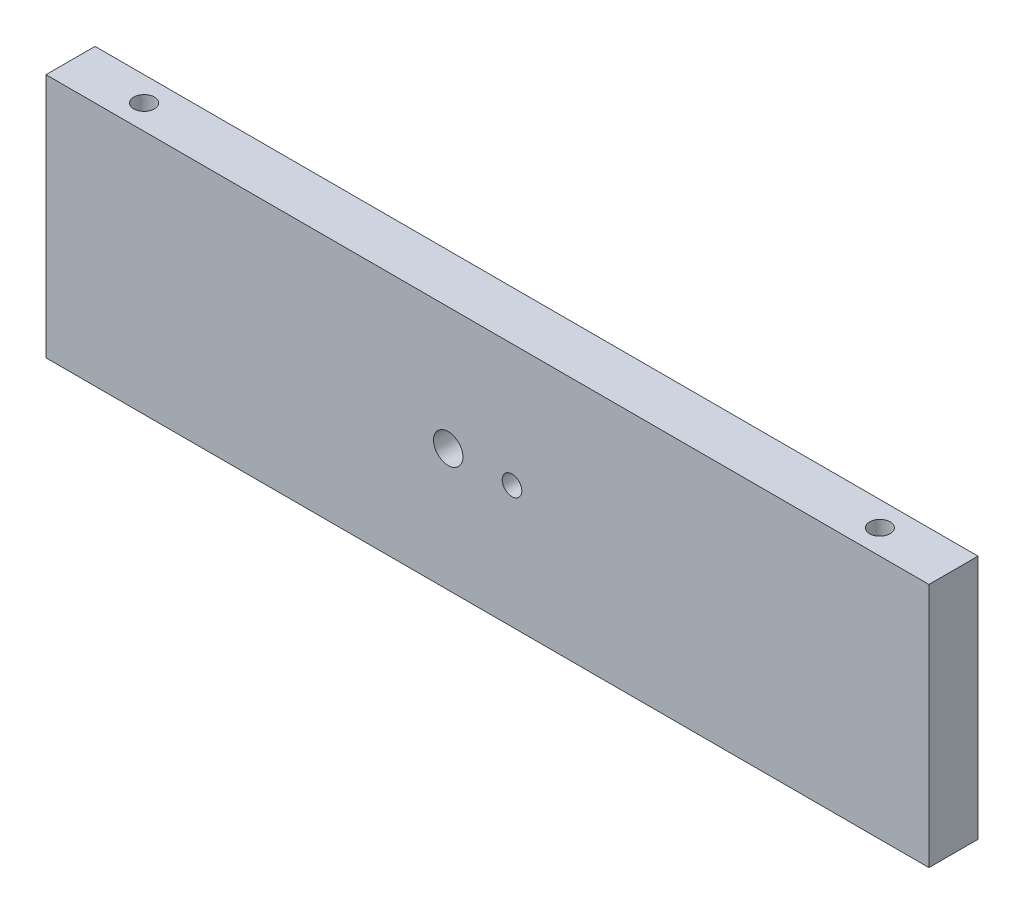
ISO-10303-21;
HEADER;
FILE_DESCRIPTION(('STEP AP214'),'2;1');
FILE_NAME('part.step','',(''),(''),'','','');
FILE_SCHEMA(('AUTOMOTIVE_DESIGN { 1 0 10303 214 1 1 1 1 }'));
ENDSEC;
DATA;
#1=APPLICATION_CONTEXT('core data for automotive mechanical design processes');
#2=APPLICATION_PROTOCOL_DEFINITION('international standard','automotive_design',2000,#1);
#3=PRODUCT_CONTEXT('',#1,'mechanical');
#4=PRODUCT('Part','Part','',(#3));
#5=PRODUCT_RELATED_PRODUCT_CATEGORY('part','',(#4));
#6=PRODUCT_DEFINITION_FORMATION('','',#4);
#7=PRODUCT_DEFINITION_CONTEXT('part definition',#1,'design');
#8=PRODUCT_DEFINITION('design','',#6,#7);
#9=PRODUCT_DEFINITION_SHAPE('','',#8);
#10=(LENGTH_UNIT() NAMED_UNIT(*) SI_UNIT(.MILLI.,.METRE.));
#11=(NAMED_UNIT(*) PLANE_ANGLE_UNIT() SI_UNIT($,.RADIAN.));
#12=(NAMED_UNIT(*) SI_UNIT($,.STERADIAN.) SOLID_ANGLE_UNIT());
#13=UNCERTAINTY_MEASURE_WITH_UNIT(LENGTH_MEASURE(1.E-05),#10,'distance_accuracy_value','');
#14=(GEOMETRIC_REPRESENTATION_CONTEXT(3) GLOBAL_UNCERTAINTY_ASSIGNED_CONTEXT((#13)) GLOBAL_UNIT_ASSIGNED_CONTEXT((#10,
#11,#12)) REPRESENTATION_CONTEXT('',''));
#15=CARTESIAN_POINT('',(0.,0.,0.));
#16=DIRECTION('',(0.,0.,1.));
#17=DIRECTION('',(1.,0.,0.));
#18=AXIS2_PLACEMENT_3D('',#15,#16,#17);
#19=CARTESIAN_POINT('',(90.,-25.,10.));
#20=DIRECTION('',(-1.,0.,0.));
#21=DIRECTION('',(0.,0.,1.));
#22=AXIS2_PLACEMENT_3D('',#19,#20,#21);
#23=PLANE('',#22);
#24=DIRECTION('',(0.,1.,0.));
#25=VECTOR('',#24,1.);
#26=CARTESIAN_POINT('',(90.,-25.,0.));
#27=LINE('',#26,#25);
#28=CARTESIAN_POINT('',(90.,-25.,0.));
#29=VERTEX_POINT('',#28);
#30=CARTESIAN_POINT('',(90.,25.,0.));
#31=VERTEX_POINT('',#30);
#32=EDGE_CURVE('E123',#29,#31,#27,.T.);
#33=ORIENTED_EDGE('',*,*,#32,.T.);
#34=DIRECTION('',(0.,0.,-1.));
#35=VECTOR('',#34,1.);
#36=CARTESIAN_POINT('',(90.,25.,10.));
#37=LINE('',#36,#35);
#38=CARTESIAN_POINT('',(90.,25.,10.));
#39=VERTEX_POINT('',#38);
#40=EDGE_CURVE('E11',#39,#31,#37,.T.);
#41=ORIENTED_EDGE('',*,*,#40,.F.);
#42=DIRECTION('',(0.,1.,0.));
#43=VECTOR('',#42,1.);
#44=CARTESIAN_POINT('',(90.,-25.,10.));
#45=LINE('',#44,#43);
#46=CARTESIAN_POINT('',(90.,-25.,10.));
#47=VERTEX_POINT('',#46);
#48=EDGE_CURVE('E126',#47,#39,#45,.T.);
#49=ORIENTED_EDGE('',*,*,#48,.F.);
#50=DIRECTION('',(0.,0.,-1.));
#51=VECTOR('',#50,1.);
#52=CARTESIAN_POINT('',(90.,-25.,10.));
#53=LINE('',#52,#51);
#54=EDGE_CURVE('E132',#47,#29,#53,.T.);
#55=ORIENTED_EDGE('',*,*,#54,.T.);
#56=EDGE_LOOP('',(#33,#41,#49,#55));
#57=FACE_BOUND('',#56,.T.);
#58=ADVANCED_FACE('F42',(#57),#23,.F.);
#59=CARTESIAN_POINT('',(-90.,25.,10.));
#60=DIRECTION('',(0.,-1.,0.));
#61=DIRECTION('',(0.,0.,-1.));
#62=AXIS2_PLACEMENT_3D('',#59,#60,#61);
#63=PLANE('',#62);
#64=CARTESIAN_POINT('',(-75.,25.,5.));
#65=DIRECTION('',(0.,1.,0.));
#66=DIRECTION('',(0.,0.,1.));
#67=AXIS2_PLACEMENT_3D('',#64,#65,#66);
#68=CIRCLE('',#67,2.09999999999999);
#69=CARTESIAN_POINT('',(-75.,25.,7.09999999999999));
#70=VERTEX_POINT('',#69);
#71=EDGE_CURVE('E107',#70,#70,#68,.T.);
#72=ORIENTED_EDGE('',*,*,#71,.F.);
#73=EDGE_LOOP('',(#72));
#74=FACE_BOUND('',#73,.T.);
#75=CARTESIAN_POINT('',(75.,25.,5.));
#76=DIRECTION('',(0.,1.,0.));
#77=DIRECTION('',(0.,0.,1.));
#78=AXIS2_PLACEMENT_3D('',#75,#76,#77);
#79=CIRCLE('',#78,2.09999999999999);
#80=CARTESIAN_POINT('',(75.,25.,7.09999999999999));
#81=VERTEX_POINT('',#80);
#82=EDGE_CURVE('E106',#81,#81,#79,.T.);
#83=ORIENTED_EDGE('',*,*,#82,.F.);
#84=EDGE_LOOP('',(#83));
#85=FACE_BOUND('',#84,.T.);
#86=DIRECTION('',(-1.,0.,0.));
#87=VECTOR('',#86,1.);
#88=CARTESIAN_POINT('',(-90.,25.,0.));
#89=LINE('',#88,#87);
#90=CARTESIAN_POINT('',(-90.,25.,0.));
#91=VERTEX_POINT('',#90);
#92=EDGE_CURVE('E135',#31,#91,#89,.T.);
#93=ORIENTED_EDGE('',*,*,#92,.T.);
#94=DIRECTION('',(0.,0.,-1.));
#95=VECTOR('',#94,1.);
#96=CARTESIAN_POINT('',(-90.,25.,10.));
#97=LINE('',#96,#95);
#98=CARTESIAN_POINT('',(-90.,25.,10.));
#99=VERTEX_POINT('',#98);
#100=EDGE_CURVE('E50',#99,#91,#97,.T.);
#101=ORIENTED_EDGE('',*,*,#100,.F.);
#102=DIRECTION('',(-1.,0.,0.));
#103=VECTOR('',#102,1.);
#104=CARTESIAN_POINT('',(-90.,25.,10.));
#105=LINE('',#104,#103);
#106=EDGE_CURVE('E89',#39,#99,#105,.T.);
#107=ORIENTED_EDGE('',*,*,#106,.F.);
#108=ORIENTED_EDGE('',*,*,#40,.T.);
#109=EDGE_LOOP('',(#93,#101,#107,#108));
#110=FACE_BOUND('',#109,.T.);
#111=ADVANCED_FACE('F159',(#74,#85,#110),#63,.F.);
#112=CARTESIAN_POINT('',(-90.,-25.,10.));
#113=DIRECTION('',(1.,0.,0.));
#114=DIRECTION('',(0.,0.,-1.));
#115=AXIS2_PLACEMENT_3D('',#112,#113,#114);
#116=PLANE('',#115);
#117=DIRECTION('',(0.,-1.,0.));
#118=VECTOR('',#117,1.);
#119=CARTESIAN_POINT('',(-90.,-25.,0.));
#120=LINE('',#119,#118);
#121=CARTESIAN_POINT('',(-90.,-25.,0.));
#122=VERTEX_POINT('',#121);
#123=EDGE_CURVE('E76',#91,#122,#120,.T.);
#124=ORIENTED_EDGE('',*,*,#123,.T.);
#125=DIRECTION('',(0.,0.,-1.));
#126=VECTOR('',#125,1.);
#127=CARTESIAN_POINT('',(-90.,-25.,10.));
#128=LINE('',#127,#126);
#129=CARTESIAN_POINT('',(-90.,-25.,10.));
#130=VERTEX_POINT('',#129);
#131=EDGE_CURVE('E140',#130,#122,#128,.T.);
#132=ORIENTED_EDGE('',*,*,#131,.F.);
#133=DIRECTION('',(0.,-1.,0.));
#134=VECTOR('',#133,1.);
#135=CARTESIAN_POINT('',(-90.,-25.,10.));
#136=LINE('',#135,#134);
#137=EDGE_CURVE('E129',#99,#130,#136,.T.);
#138=ORIENTED_EDGE('',*,*,#137,.F.);
#139=ORIENTED_EDGE('',*,*,#100,.T.);
#140=EDGE_LOOP('',(#124,#132,#138,#139));
#141=FACE_BOUND('',#140,.T.);
#142=ADVANCED_FACE('F142',(#141),#116,.F.);
#143=CARTESIAN_POINT('',(-90.,-25.,10.));
#144=DIRECTION('',(0.,1.,0.));
#145=DIRECTION('',(0.,0.,1.));
#146=AXIS2_PLACEMENT_3D('',#143,#144,#145);
#147=PLANE('',#146);
#148=DIRECTION('',(1.,0.,0.));
#149=VECTOR('',#148,1.);
#150=CARTESIAN_POINT('',(-90.,-25.,0.));
#151=LINE('',#150,#149);
#152=EDGE_CURVE('E82',#122,#29,#151,.T.);
#153=ORIENTED_EDGE('',*,*,#152,.T.);
#154=ORIENTED_EDGE('',*,*,#54,.F.);
#155=DIRECTION('',(1.,0.,0.));
#156=VECTOR('',#155,1.);
#157=CARTESIAN_POINT('',(-90.,-25.,10.));
#158=LINE('',#157,#156);
#159=EDGE_CURVE('E58',#130,#47,#158,.T.);
#160=ORIENTED_EDGE('',*,*,#159,.F.);
#161=ORIENTED_EDGE('',*,*,#131,.T.);
#162=EDGE_LOOP('',(#153,#154,#160,#161));
#163=FACE_BOUND('',#162,.T.);
#164=ADVANCED_FACE('F149',(#163),#147,.F.);
#165=CARTESIAN_POINT('',(0.,0.,10.));
#166=DIRECTION('',(0.,0.,-1.));
#167=DIRECTION('',(-1.,0.,0.));
#168=AXIS2_PLACEMENT_3D('',#165,#166,#167);
#169=PLANE('',#168);
#170=CARTESIAN_POINT('',(5.,0.,10.));
#171=DIRECTION('',(0.,0.,1.));
#172=DIRECTION('',(1.,0.,0.));
#173=AXIS2_PLACEMENT_3D('',#170,#171,#172);
#174=CIRCLE('',#173,2.);
#175=CARTESIAN_POINT('',(7.,0.,10.));
#176=VERTEX_POINT('',#175);
#177=EDGE_CURVE('E200',#176,#176,#174,.T.);
#178=ORIENTED_EDGE('',*,*,#177,.F.);
#179=EDGE_LOOP('',(#178));
#180=FACE_BOUND('',#179,.T.);
#181=CARTESIAN_POINT('',(-8.,0.,10.));
#182=DIRECTION('',(0.,0.,1.));
#183=DIRECTION('',(1.,0.,0.));
#184=AXIS2_PLACEMENT_3D('',#181,#182,#183);
#185=CIRCLE('',#184,3.);
#186=CARTESIAN_POINT('',(-5.,0.,10.));
#187=VERTEX_POINT('',#186);
#188=EDGE_CURVE('E119',#187,#187,#185,.T.);
#189=ORIENTED_EDGE('',*,*,#188,.F.);
#190=EDGE_LOOP('',(#189));
#191=FACE_BOUND('',#190,.T.);
#192=ORIENTED_EDGE('',*,*,#48,.T.);
#193=ORIENTED_EDGE('',*,*,#106,.T.);
#194=ORIENTED_EDGE('',*,*,#137,.T.);
#195=ORIENTED_EDGE('',*,*,#159,.T.);
#196=EDGE_LOOP('',(#192,#193,#194,#195));
#197=FACE_BOUND('',#196,.T.);
#198=ADVANCED_FACE('F151',(#180,#191,#197),#169,.F.);
#199=CARTESIAN_POINT('',(0.,0.,0.));
#200=DIRECTION('',(0.,0.,-1.));
#201=DIRECTION('',(-1.,0.,0.));
#202=AXIS2_PLACEMENT_3D('',#199,#200,#201);
#203=PLANE('',#202);
#204=CARTESIAN_POINT('',(5.,0.,0.));
#205=DIRECTION('',(0.,0.,1.));
#206=DIRECTION('',(1.,0.,0.));
#207=AXIS2_PLACEMENT_3D('',#204,#205,#206);
#208=CIRCLE('',#207,2.);
#209=CARTESIAN_POINT('',(7.,0.,0.));
#210=VERTEX_POINT('',#209);
#211=EDGE_CURVE('E113',#210,#210,#208,.T.);
#212=ORIENTED_EDGE('',*,*,#211,.T.);
#213=EDGE_LOOP('',(#212));
#214=FACE_BOUND('',#213,.T.);
#215=CARTESIAN_POINT('',(-8.,0.,0.));
#216=DIRECTION('',(0.,0.,1.));
#217=DIRECTION('',(1.,0.,0.));
#218=AXIS2_PLACEMENT_3D('',#215,#216,#217);
#219=CIRCLE('',#218,3.);
#220=CARTESIAN_POINT('',(-5.,0.,0.));
#221=VERTEX_POINT('',#220);
#222=EDGE_CURVE('E120',#221,#221,#219,.T.);
#223=ORIENTED_EDGE('',*,*,#222,.T.);
#224=EDGE_LOOP('',(#223));
#225=FACE_BOUND('',#224,.T.);
#226=ORIENTED_EDGE('',*,*,#32,.F.);
#227=ORIENTED_EDGE('',*,*,#152,.F.);
#228=ORIENTED_EDGE('',*,*,#123,.F.);
#229=ORIENTED_EDGE('',*,*,#92,.F.);
#230=EDGE_LOOP('',(#226,#227,#228,#229));
#231=FACE_BOUND('',#230,.T.);
#232=ADVANCED_FACE('F145',(#214,#225,#231),#203,.T.);
#233=CARTESIAN_POINT('',(-8.,0.,0.));
#234=DIRECTION('',(0.,0.,1.));
#235=DIRECTION('',(1.,0.,0.));
#236=AXIS2_PLACEMENT_3D('',#233,#234,#235);
#237=CYLINDRICAL_SURFACE('',#236,3.);
#238=ORIENTED_EDGE('',*,*,#222,.F.);
#239=EDGE_LOOP('',(#238));
#240=FACE_BOUND('',#239,.T.);
#241=ORIENTED_EDGE('',*,*,#188,.T.);
#242=EDGE_LOOP('',(#241));
#243=FACE_BOUND('',#242,.T.);
#244=ADVANCED_FACE('F180',(#240,#243),#237,.F.);
#245=CARTESIAN_POINT('',(75.,11.,5.));
#246=DIRECTION('',(0.,1.,0.));
#247=DIRECTION('',(0.,0.,1.));
#248=AXIS2_PLACEMENT_3D('',#245,#246,#247);
#249=CONICAL_SURFACE('',#248,2.09999999999999,1.02974425867666);
#250=CARTESIAN_POINT('',(75.,9.73819270004213,5.));
#251=VERTEX_POINT('',#250);
#252=VERTEX_LOOP('',#251);
#253=FACE_BOUND('',#252,.T.);
#254=CARTESIAN_POINT('',(75.,11.,5.));
#255=DIRECTION('',(0.,1.,0.));
#256=DIRECTION('',(0.,0.,1.));
#257=AXIS2_PLACEMENT_3D('',#254,#255,#256);
#258=CIRCLE('',#257,2.09999999999999);
#259=CARTESIAN_POINT('',(75.,11.,7.09999999999999));
#260=VERTEX_POINT('',#259);
#261=EDGE_CURVE('E110',#260,#260,#258,.T.);
#262=ORIENTED_EDGE('',*,*,#261,.T.);
#263=EDGE_LOOP('',(#262));
#264=FACE_BOUND('',#263,.T.);
#265=ADVANCED_FACE('F174',(#253,#264),#249,.F.);
#266=CARTESIAN_POINT('',(75.,25.,5.));
#267=DIRECTION('',(0.,1.,0.));
#268=DIRECTION('',(0.,0.,1.));
#269=AXIS2_PLACEMENT_3D('',#266,#267,#268);
#270=CYLINDRICAL_SURFACE('',#269,2.09999999999999);
#271=ORIENTED_EDGE('',*,*,#261,.F.);
#272=EDGE_LOOP('',(#271));
#273=FACE_BOUND('',#272,.T.);
#274=ORIENTED_EDGE('',*,*,#82,.T.);
#275=EDGE_LOOP('',(#274));
#276=FACE_BOUND('',#275,.T.);
#277=ADVANCED_FACE('F100',(#273,#276),#270,.F.);
#278=CARTESIAN_POINT('',(-75.,11.,5.));
#279=DIRECTION('',(0.,1.,0.));
#280=DIRECTION('',(0.,0.,1.));
#281=AXIS2_PLACEMENT_3D('',#278,#279,#280);
#282=CONICAL_SURFACE('',#281,2.09999999999999,1.02974425867666);
#283=CARTESIAN_POINT('',(-75.,9.73819270004213,5.));
#284=VERTEX_POINT('',#283);
#285=VERTEX_LOOP('',#284);
#286=FACE_BOUND('',#285,.T.);
#287=CARTESIAN_POINT('',(-75.,11.,5.));
#288=DIRECTION('',(0.,1.,0.));
#289=DIRECTION('',(0.,0.,1.));
#290=AXIS2_PLACEMENT_3D('',#287,#288,#289);
#291=CIRCLE('',#290,2.09999999999999);
#292=CARTESIAN_POINT('',(-75.,11.,7.09999999999999));
#293=VERTEX_POINT('',#292);
#294=EDGE_CURVE('E104',#293,#293,#291,.T.);
#295=ORIENTED_EDGE('',*,*,#294,.T.);
#296=EDGE_LOOP('',(#295));
#297=FACE_BOUND('',#296,.T.);
#298=ADVANCED_FACE('F96',(#286,#297),#282,.F.);
#299=CARTESIAN_POINT('',(-75.,25.,5.));
#300=DIRECTION('',(0.,1.,0.));
#301=DIRECTION('',(0.,0.,1.));
#302=AXIS2_PLACEMENT_3D('',#299,#300,#301);
#303=CYLINDRICAL_SURFACE('',#302,2.09999999999999);
#304=ORIENTED_EDGE('',*,*,#294,.F.);
#305=EDGE_LOOP('',(#304));
#306=FACE_BOUND('',#305,.T.);
#307=ORIENTED_EDGE('',*,*,#71,.T.);
#308=EDGE_LOOP('',(#307));
#309=FACE_BOUND('',#308,.T.);
#310=ADVANCED_FACE('F99',(#306,#309),#303,.F.);
#311=CARTESIAN_POINT('',(5.,0.,0.));
#312=DIRECTION('',(0.,0.,1.));
#313=DIRECTION('',(1.,0.,0.));
#314=AXIS2_PLACEMENT_3D('',#311,#312,#313);
#315=CYLINDRICAL_SURFACE('',#314,2.);
#316=ORIENTED_EDGE('',*,*,#211,.F.);
#317=EDGE_LOOP('',(#316));
#318=FACE_BOUND('',#317,.T.);
#319=ORIENTED_EDGE('',*,*,#177,.T.);
#320=EDGE_LOOP('',(#319));
#321=FACE_BOUND('',#320,.T.);
#322=ADVANCED_FACE('F205',(#318,#321),#315,.F.);
#323=CLOSED_SHELL('',(#58,#111,#142,#164,#198,#232,#244,#265,#277,#298,#310,#322));
#324=MANIFOLD_SOLID_BREP('B2',#323);
#325=ADVANCED_BREP_SHAPE_REPRESENTATION('',(#18,#324),#14);
#326=SHAPE_DEFINITION_REPRESENTATION(#9,#325);
ENDSEC;
END-ISO-10303-21;
